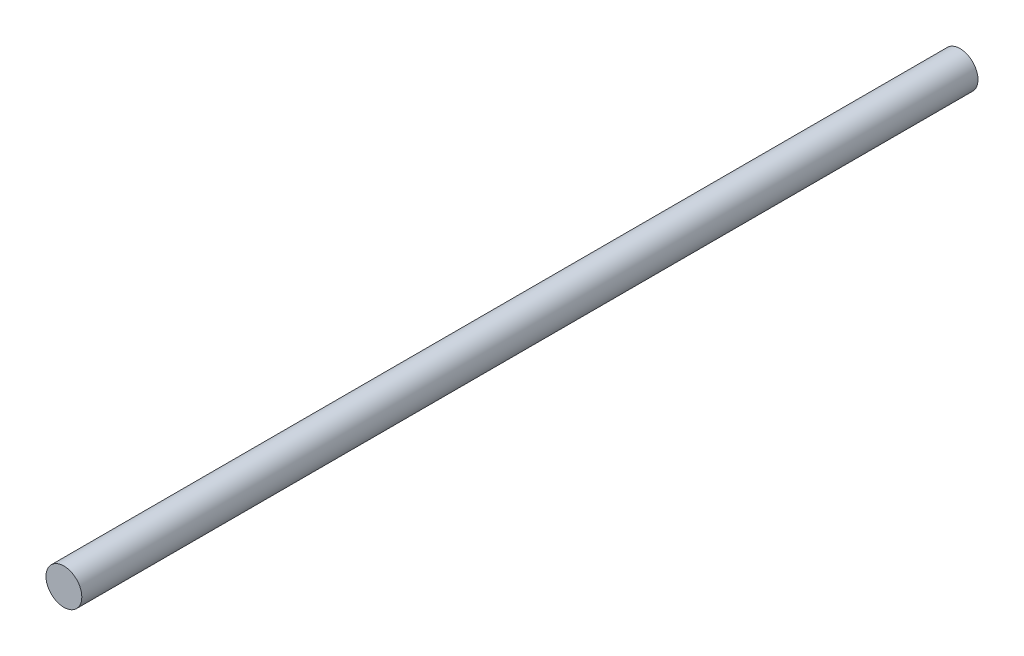
ISO-10303-21;
HEADER;
FILE_DESCRIPTION(('STEP AP214'),'2;1');
FILE_NAME('part.step','',(''),(''),'','','');
FILE_SCHEMA(('AUTOMOTIVE_DESIGN { 1 0 10303 214 1 1 1 1 }'));
ENDSEC;
DATA;
#1=APPLICATION_CONTEXT('core data for automotive mechanical design processes');
#2=APPLICATION_PROTOCOL_DEFINITION('international standard','automotive_design',2000,#1);
#3=PRODUCT_CONTEXT('',#1,'mechanical');
#4=PRODUCT('Part','Part','',(#3));
#5=PRODUCT_RELATED_PRODUCT_CATEGORY('part','',(#4));
#6=PRODUCT_DEFINITION_FORMATION('','',#4);
#7=PRODUCT_DEFINITION_CONTEXT('part definition',#1,'design');
#8=PRODUCT_DEFINITION('design','',#6,#7);
#9=PRODUCT_DEFINITION_SHAPE('','',#8);
#10=(LENGTH_UNIT() NAMED_UNIT(*) SI_UNIT(.MILLI.,.METRE.));
#11=(NAMED_UNIT(*) PLANE_ANGLE_UNIT() SI_UNIT($,.RADIAN.));
#12=(NAMED_UNIT(*) SI_UNIT($,.STERADIAN.) SOLID_ANGLE_UNIT());
#13=UNCERTAINTY_MEASURE_WITH_UNIT(LENGTH_MEASURE(1.E-05),#10,'distance_accuracy_value','');
#14=(GEOMETRIC_REPRESENTATION_CONTEXT(3) GLOBAL_UNCERTAINTY_ASSIGNED_CONTEXT((#13)) GLOBAL_UNIT_ASSIGNED_CONTEXT((#10,
#11,#12)) REPRESENTATION_CONTEXT('',''));
#15=CARTESIAN_POINT('',(0.,0.,0.));
#16=DIRECTION('',(0.,0.,1.));
#17=DIRECTION('',(1.,0.,0.));
#18=AXIS2_PLACEMENT_3D('',#15,#16,#17);
#19=CARTESIAN_POINT('',(2.6,7.00000000000402,-16.2));
#20=DIRECTION('',(0.,0.,1.));
#21=DIRECTION('',(1.,0.,0.));
#22=AXIS2_PLACEMENT_3D('',#19,#20,#21);
#23=PLANE('',#22);
#24=CARTESIAN_POINT('',(2.6,7.00000000000402,-16.2));
#25=DIRECTION('',(0.,0.,1.));
#26=DIRECTION('',(-1.,0.,0.));
#27=AXIS2_PLACEMENT_3D('',#24,#25,#26);
#28=CIRCLE('',#27,0.6);
#29=CARTESIAN_POINT('',(3.2,7.00000000000402,-16.2));
#30=VERTEX_POINT('',#29);
#31=EDGE_CURVE('E11',#30,#30,#28,.T.);
#32=ORIENTED_EDGE('',*,*,#31,.F.);
#33=EDGE_LOOP('',(#32));
#34=FACE_BOUND('',#33,.T.);
#35=ADVANCED_FACE('F17',(#34),#23,.F.);
#36=CARTESIAN_POINT('',(2.6,7.00000000000402,13.8));
#37=DIRECTION('',(0.,0.,1.));
#38=DIRECTION('',(1.,0.,0.));
#39=AXIS2_PLACEMENT_3D('',#36,#37,#38);
#40=PLANE('',#39);
#41=CARTESIAN_POINT('',(2.6,7.00000000000402,13.8));
#42=DIRECTION('',(0.,0.,1.));
#43=DIRECTION('',(-1.,0.,0.));
#44=AXIS2_PLACEMENT_3D('',#41,#42,#43);
#45=CIRCLE('',#44,0.6);
#46=CARTESIAN_POINT('',(3.2,7.00000000000402,13.8));
#47=VERTEX_POINT('',#46);
#48=EDGE_CURVE('E40',#47,#47,#45,.T.);
#49=ORIENTED_EDGE('',*,*,#48,.T.);
#50=EDGE_LOOP('',(#49));
#51=FACE_BOUND('',#50,.T.);
#52=ADVANCED_FACE('F19',(#51),#40,.T.);
#53=CARTESIAN_POINT('',(2.6,7.00000000000402,-16.2));
#54=DIRECTION('',(0.,0.,1.));
#55=DIRECTION('',(-1.,0.,0.));
#56=AXIS2_PLACEMENT_3D('',#53,#54,#55);
#57=CYLINDRICAL_SURFACE('',#56,0.6);
#58=ORIENTED_EDGE('',*,*,#48,.F.);
#59=DIRECTION('',(0.,0.,-1.));
#60=VECTOR('',#59,1.);
#61=CARTESIAN_POINT('',(3.2,7.00000000000402,-16.2));
#62=LINE('',#61,#60);
#63=EDGE_CURVE('E21',#47,#30,#62,.T.);
#64=ORIENTED_EDGE('',*,*,#63,.T.);
#65=ORIENTED_EDGE('',*,*,#31,.T.);
#66=ORIENTED_EDGE('',*,*,#63,.F.);
#67=EDGE_LOOP('',(#58,#64,#65,#66));
#68=FACE_BOUND('',#67,.T.);
#69=ADVANCED_FACE('F39',(#68),#57,.T.);
#70=CLOSED_SHELL('',(#35,#52,#69));
#71=MANIFOLD_SOLID_BREP('B1',#70);
#72=ADVANCED_BREP_SHAPE_REPRESENTATION('',(#18,#71),#14);
#73=SHAPE_DEFINITION_REPRESENTATION(#9,#72);
ENDSEC;
END-ISO-10303-21;
